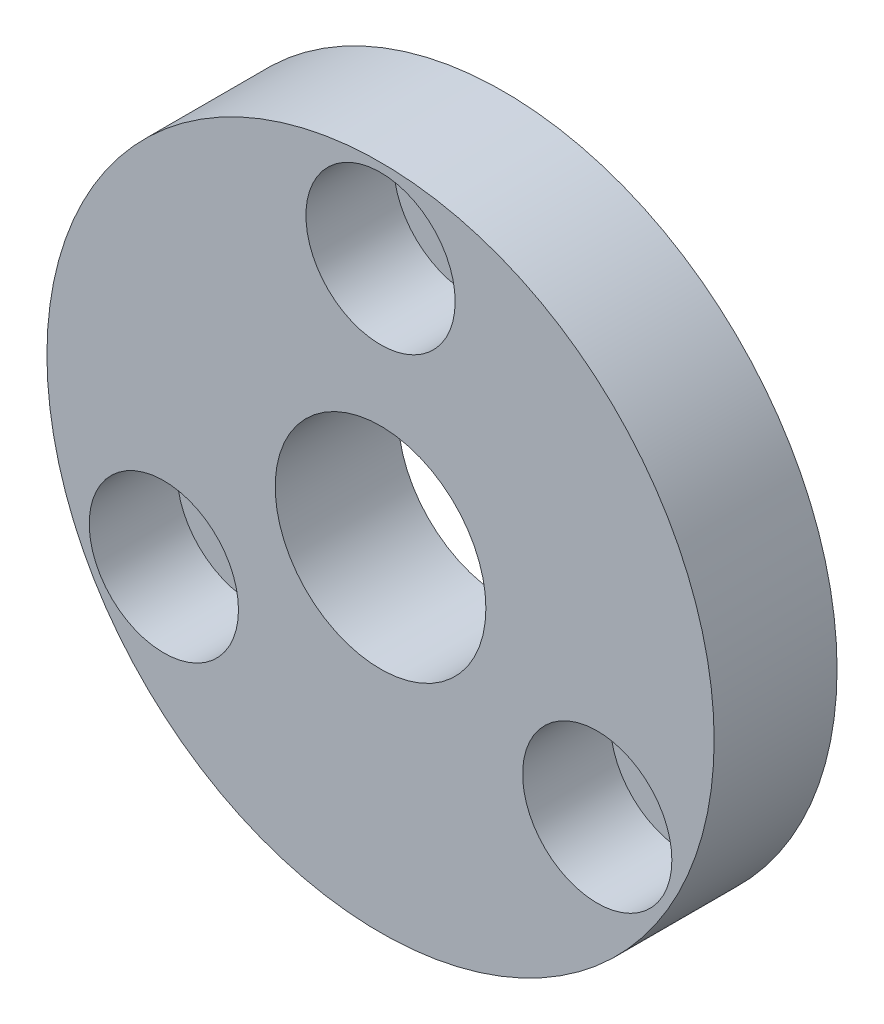
ISO-10303-21;
HEADER;
FILE_DESCRIPTION(('STEP AP214'),'2;1');
FILE_NAME('part.step','',(''),(''),'','','');
FILE_SCHEMA(('AUTOMOTIVE_DESIGN { 1 0 10303 214 1 1 1 1 }'));
ENDSEC;
DATA;
#1=APPLICATION_CONTEXT('core data for automotive mechanical design processes');
#2=APPLICATION_PROTOCOL_DEFINITION('international standard','automotive_design',2000,#1);
#3=PRODUCT_CONTEXT('',#1,'mechanical');
#4=PRODUCT('Part','Part','',(#3));
#5=PRODUCT_RELATED_PRODUCT_CATEGORY('part','',(#4));
#6=PRODUCT_DEFINITION_FORMATION('','',#4);
#7=PRODUCT_DEFINITION_CONTEXT('part definition',#1,'design');
#8=PRODUCT_DEFINITION('design','',#6,#7);
#9=PRODUCT_DEFINITION_SHAPE('','',#8);
#10=(LENGTH_UNIT() NAMED_UNIT(*) SI_UNIT(.MILLI.,.METRE.));
#11=(NAMED_UNIT(*) PLANE_ANGLE_UNIT() SI_UNIT($,.RADIAN.));
#12=(NAMED_UNIT(*) SI_UNIT($,.STERADIAN.) SOLID_ANGLE_UNIT());
#13=UNCERTAINTY_MEASURE_WITH_UNIT(LENGTH_MEASURE(1.E-05),#10,'distance_accuracy_value','');
#14=(GEOMETRIC_REPRESENTATION_CONTEXT(3) GLOBAL_UNCERTAINTY_ASSIGNED_CONTEXT((#13)) GLOBAL_UNIT_ASSIGNED_CONTEXT((#10,
#11,#12)) REPRESENTATION_CONTEXT('',''));
#15=CARTESIAN_POINT('',(0.,0.,0.));
#16=DIRECTION('',(0.,0.,1.));
#17=DIRECTION('',(1.,0.,0.));
#18=AXIS2_PLACEMENT_3D('',#15,#16,#17);
#19=CARTESIAN_POINT('',(12.3408620039285,-7.12499999999986,7.));
#20=DIRECTION('',(0.,0.,-1.));
#21=DIRECTION('',(-1.,0.,0.));
#22=AXIS2_PLACEMENT_3D('',#19,#20,#21);
#23=CYLINDRICAL_SURFACE('',#22,2.5);
#24=CARTESIAN_POINT('',(12.3408620039285,-7.12499999999986,0.));
#25=DIRECTION('',(0.,0.,1.));
#26=DIRECTION('',(1.,0.,0.));
#27=AXIS2_PLACEMENT_3D('',#24,#25,#26);
#28=CIRCLE('',#27,2.5);
#29=CARTESIAN_POINT('',(14.8408620039285,-7.12499999999986,0.));
#30=VERTEX_POINT('',#29);
#31=EDGE_CURVE('E75',#30,#30,#28,.T.);
#32=ORIENTED_EDGE('',*,*,#31,.F.);
#33=EDGE_LOOP('',(#32));
#34=FACE_BOUND('',#33,.T.);
#35=CARTESIAN_POINT('',(12.3408620039285,-7.12499999999986,2.));
#36=DIRECTION('',(0.,0.,1.));
#37=DIRECTION('',(1.,0.,0.));
#38=AXIS2_PLACEMENT_3D('',#35,#36,#37);
#39=CIRCLE('',#38,2.5);
#40=CARTESIAN_POINT('',(14.8408620039285,-7.12499999999986,2.));
#41=VERTEX_POINT('',#40);
#42=EDGE_CURVE('E33',#41,#41,#39,.T.);
#43=ORIENTED_EDGE('',*,*,#42,.T.);
#44=EDGE_LOOP('',(#43));
#45=FACE_BOUND('',#44,.T.);
#46=ADVANCED_FACE('F29',(#34,#45),#23,.F.);
#47=CARTESIAN_POINT('',(-12.340862003928,-7.12500000000014,7.));
#48=DIRECTION('',(0.,0.,-1.));
#49=DIRECTION('',(-1.,0.,0.));
#50=AXIS2_PLACEMENT_3D('',#47,#48,#49);
#51=CYLINDRICAL_SURFACE('',#50,2.5);
#52=CARTESIAN_POINT('',(-12.340862003928,-7.12500000000014,0.));
#53=DIRECTION('',(0.,0.,1.));
#54=DIRECTION('',(1.,0.,0.));
#55=AXIS2_PLACEMENT_3D('',#52,#53,#54);
#56=CIRCLE('',#55,2.5);
#57=CARTESIAN_POINT('',(-9.84086200392801,-7.12500000000014,0.));
#58=VERTEX_POINT('',#57);
#59=EDGE_CURVE('E50',#58,#58,#56,.T.);
#60=ORIENTED_EDGE('',*,*,#59,.F.);
#61=EDGE_LOOP('',(#60));
#62=FACE_BOUND('',#61,.T.);
#63=CARTESIAN_POINT('',(-12.340862003928,-7.12500000000014,2.));
#64=DIRECTION('',(0.,0.,1.));
#65=DIRECTION('',(1.,0.,0.));
#66=AXIS2_PLACEMENT_3D('',#63,#64,#65);
#67=CIRCLE('',#66,2.5);
#68=CARTESIAN_POINT('',(-9.84086200392801,-7.12500000000014,2.));
#69=VERTEX_POINT('',#68);
#70=EDGE_CURVE('E52',#69,#69,#67,.T.);
#71=ORIENTED_EDGE('',*,*,#70,.T.);
#72=EDGE_LOOP('',(#71));
#73=FACE_BOUND('',#72,.T.);
#74=ADVANCED_FACE('F104',(#62,#73),#51,.F.);
#75=CARTESIAN_POINT('',(0.,14.25,7.));
#76=DIRECTION('',(0.,0.,-1.));
#77=DIRECTION('',(-1.,0.,0.));
#78=AXIS2_PLACEMENT_3D('',#75,#76,#77);
#79=CYLINDRICAL_SURFACE('',#78,2.5);
#80=CARTESIAN_POINT('',(0.,14.25,0.));
#81=DIRECTION('',(0.,0.,1.));
#82=DIRECTION('',(1.,0.,0.));
#83=AXIS2_PLACEMENT_3D('',#80,#81,#82);
#84=CIRCLE('',#83,2.5);
#85=CARTESIAN_POINT('',(2.5,14.25,0.));
#86=VERTEX_POINT('',#85);
#87=EDGE_CURVE('E78',#86,#86,#84,.T.);
#88=ORIENTED_EDGE('',*,*,#87,.F.);
#89=EDGE_LOOP('',(#88));
#90=FACE_BOUND('',#89,.T.);
#91=CARTESIAN_POINT('',(0.,14.25,2.));
#92=DIRECTION('',(0.,0.,1.));
#93=DIRECTION('',(1.,0.,0.));
#94=AXIS2_PLACEMENT_3D('',#91,#92,#93);
#95=CIRCLE('',#94,2.5);
#96=CARTESIAN_POINT('',(2.5,14.25,2.));
#97=VERTEX_POINT('',#96);
#98=EDGE_CURVE('E48',#97,#97,#95,.T.);
#99=ORIENTED_EDGE('',*,*,#98,.T.);
#100=EDGE_LOOP('',(#99));
#101=FACE_BOUND('',#100,.T.);
#102=ADVANCED_FACE('F110',(#90,#101),#79,.F.);
#103=CARTESIAN_POINT('',(0.,0.,7.));
#104=DIRECTION('',(0.,0.,1.));
#105=DIRECTION('',(1.,0.,0.));
#106=AXIS2_PLACEMENT_3D('',#103,#104,#105);
#107=PLANE('',#106);
#108=CARTESIAN_POINT('',(12.3408620039285,-7.12499999999986,7.));
#109=DIRECTION('',(0.,0.,1.));
#110=DIRECTION('',(1.,0.,0.));
#111=AXIS2_PLACEMENT_3D('',#108,#109,#110);
#112=CIRCLE('',#111,4.25);
#113=CARTESIAN_POINT('',(16.5908620039285,-7.12499999999986,7.));
#114=VERTEX_POINT('',#113);
#115=EDGE_CURVE('E68',#114,#114,#112,.T.);
#116=ORIENTED_EDGE('',*,*,#115,.F.);
#117=EDGE_LOOP('',(#116));
#118=FACE_BOUND('',#117,.T.);
#119=CARTESIAN_POINT('',(-12.340862003928,-7.12500000000014,7.));
#120=DIRECTION('',(0.,0.,1.));
#121=DIRECTION('',(1.,0.,0.));
#122=AXIS2_PLACEMENT_3D('',#119,#120,#121);
#123=CIRCLE('',#122,4.25);
#124=CARTESIAN_POINT('',(-8.09086200392801,-7.12500000000014,7.));
#125=VERTEX_POINT('',#124);
#126=EDGE_CURVE('E61',#125,#125,#123,.T.);
#127=ORIENTED_EDGE('',*,*,#126,.F.);
#128=EDGE_LOOP('',(#127));
#129=FACE_BOUND('',#128,.T.);
#130=CARTESIAN_POINT('',(0.,14.25,7.));
#131=DIRECTION('',(0.,0.,1.));
#132=DIRECTION('',(1.,0.,0.));
#133=AXIS2_PLACEMENT_3D('',#130,#131,#132);
#134=CIRCLE('',#133,4.25);
#135=CARTESIAN_POINT('',(4.25,14.25,7.));
#136=VERTEX_POINT('',#135);
#137=EDGE_CURVE('E54',#136,#136,#134,.T.);
#138=ORIENTED_EDGE('',*,*,#137,.F.);
#139=EDGE_LOOP('',(#138));
#140=FACE_BOUND('',#139,.T.);
#141=CARTESIAN_POINT('',(0.,0.,7.));
#142=DIRECTION('',(0.,0.,1.));
#143=DIRECTION('',(1.,0.,0.));
#144=AXIS2_PLACEMENT_3D('',#141,#142,#143);
#145=CIRCLE('',#144,6.);
#146=CARTESIAN_POINT('',(6.,0.,7.));
#147=VERTEX_POINT('',#146);
#148=EDGE_CURVE('E42',#147,#147,#145,.T.);
#149=ORIENTED_EDGE('',*,*,#148,.F.);
#150=EDGE_LOOP('',(#149));
#151=FACE_BOUND('',#150,.T.);
#152=CARTESIAN_POINT('',(0.,0.,7.));
#153=DIRECTION('',(0.,0.,1.));
#154=DIRECTION('',(1.,0.,0.));
#155=AXIS2_PLACEMENT_3D('',#152,#153,#154);
#156=CIRCLE('',#155,19.);
#157=CARTESIAN_POINT('',(19.,0.,7.));
#158=VERTEX_POINT('',#157);
#159=EDGE_CURVE('E10',#158,#158,#156,.T.);
#160=ORIENTED_EDGE('',*,*,#159,.T.);
#161=EDGE_LOOP('',(#160));
#162=FACE_BOUND('',#161,.T.);
#163=ADVANCED_FACE('F116',(#118,#129,#140,#151,#162),#107,.T.);
#164=CARTESIAN_POINT('',(0.,0.,0.));
#165=DIRECTION('',(0.,0.,1.));
#166=DIRECTION('',(1.,0.,0.));
#167=AXIS2_PLACEMENT_3D('',#164,#165,#166);
#168=PLANE('',#167);
#169=ORIENTED_EDGE('',*,*,#31,.T.);
#170=EDGE_LOOP('',(#169));
#171=FACE_BOUND('',#170,.T.);
#172=CARTESIAN_POINT('',(0.,0.,0.));
#173=DIRECTION('',(0.,0.,1.));
#174=DIRECTION('',(1.,0.,0.));
#175=AXIS2_PLACEMENT_3D('',#172,#173,#174);
#176=CIRCLE('',#175,6.);
#177=CARTESIAN_POINT('',(6.,0.,0.));
#178=VERTEX_POINT('',#177);
#179=EDGE_CURVE('E45',#178,#178,#176,.T.);
#180=ORIENTED_EDGE('',*,*,#179,.T.);
#181=EDGE_LOOP('',(#180));
#182=FACE_BOUND('',#181,.T.);
#183=CARTESIAN_POINT('',(0.,0.,0.));
#184=DIRECTION('',(0.,0.,1.));
#185=DIRECTION('',(1.,0.,0.));
#186=AXIS2_PLACEMENT_3D('',#183,#184,#185);
#187=CIRCLE('',#186,19.);
#188=CARTESIAN_POINT('',(19.,0.,0.));
#189=VERTEX_POINT('',#188);
#190=EDGE_CURVE('E37',#189,#189,#187,.T.);
#191=ORIENTED_EDGE('',*,*,#190,.F.);
#192=EDGE_LOOP('',(#191));
#193=FACE_BOUND('',#192,.T.);
#194=ORIENTED_EDGE('',*,*,#87,.T.);
#195=EDGE_LOOP('',(#194));
#196=FACE_BOUND('',#195,.T.);
#197=ORIENTED_EDGE('',*,*,#59,.T.);
#198=EDGE_LOOP('',(#197));
#199=FACE_BOUND('',#198,.T.);
#200=ADVANCED_FACE('F86',(#171,#182,#193,#196,#199),#168,.F.);
#201=CARTESIAN_POINT('',(0.,0.,7.));
#202=DIRECTION('',(0.,0.,-1.));
#203=DIRECTION('',(-1.,0.,0.));
#204=AXIS2_PLACEMENT_3D('',#201,#202,#203);
#205=CYLINDRICAL_SURFACE('',#204,19.);
#206=ORIENTED_EDGE('',*,*,#159,.F.);
#207=EDGE_LOOP('',(#206));
#208=FACE_BOUND('',#207,.T.);
#209=ORIENTED_EDGE('',*,*,#190,.T.);
#210=EDGE_LOOP('',(#209));
#211=FACE_BOUND('',#210,.T.);
#212=ADVANCED_FACE('F31',(#208,#211),#205,.T.);
#213=CARTESIAN_POINT('',(0.,0.,7.));
#214=DIRECTION('',(0.,0.,-1.));
#215=DIRECTION('',(-1.,0.,0.));
#216=AXIS2_PLACEMENT_3D('',#213,#214,#215);
#217=CYLINDRICAL_SURFACE('',#216,6.);
#218=ORIENTED_EDGE('',*,*,#148,.T.);
#219=EDGE_LOOP('',(#218));
#220=FACE_BOUND('',#219,.T.);
#221=ORIENTED_EDGE('',*,*,#179,.F.);
#222=EDGE_LOOP('',(#221));
#223=FACE_BOUND('',#222,.T.);
#224=ADVANCED_FACE('F89',(#220,#223),#217,.F.);
#225=CARTESIAN_POINT('',(0.,14.25,2.));
#226=DIRECTION('',(0.,0.,1.));
#227=DIRECTION('',(1.,0.,0.));
#228=AXIS2_PLACEMENT_3D('',#225,#226,#227);
#229=CYLINDRICAL_SURFACE('',#228,4.25);
#230=CARTESIAN_POINT('',(0.,14.25,2.));
#231=DIRECTION('',(0.,0.,1.));
#232=DIRECTION('',(1.,0.,0.));
#233=AXIS2_PLACEMENT_3D('',#230,#231,#232);
#234=CIRCLE('',#233,4.25);
#235=CARTESIAN_POINT('',(4.25,14.25,2.));
#236=VERTEX_POINT('',#235);
#237=EDGE_CURVE('E51',#236,#236,#234,.T.);
#238=ORIENTED_EDGE('',*,*,#237,.F.);
#239=EDGE_LOOP('',(#238));
#240=FACE_BOUND('',#239,.T.);
#241=ORIENTED_EDGE('',*,*,#137,.T.);
#242=EDGE_LOOP('',(#241));
#243=FACE_BOUND('',#242,.T.);
#244=ADVANCED_FACE('F91',(#240,#243),#229,.F.);
#245=CARTESIAN_POINT('',(0.,14.25,2.));
#246=DIRECTION('',(0.,0.,1.));
#247=DIRECTION('',(1.,0.,0.));
#248=AXIS2_PLACEMENT_3D('',#245,#246,#247);
#249=PLANE('',#248);
#250=ORIENTED_EDGE('',*,*,#98,.F.);
#251=EDGE_LOOP('',(#250));
#252=FACE_BOUND('',#251,.T.);
#253=ORIENTED_EDGE('',*,*,#237,.T.);
#254=EDGE_LOOP('',(#253));
#255=FACE_BOUND('',#254,.T.);
#256=ADVANCED_FACE('F97',(#252,#255),#249,.T.);
#257=CARTESIAN_POINT('',(-12.340862003928,-7.12500000000014,2.));
#258=DIRECTION('',(0.,0.,1.));
#259=DIRECTION('',(1.,0.,0.));
#260=AXIS2_PLACEMENT_3D('',#257,#258,#259);
#261=CYLINDRICAL_SURFACE('',#260,4.25);
#262=CARTESIAN_POINT('',(-12.340862003928,-7.12500000000014,2.));
#263=DIRECTION('',(0.,0.,1.));
#264=DIRECTION('',(1.,0.,0.));
#265=AXIS2_PLACEMENT_3D('',#262,#263,#264);
#266=CIRCLE('',#265,4.25);
#267=CARTESIAN_POINT('',(-8.09086200392801,-7.12500000000014,2.));
#268=VERTEX_POINT('',#267);
#269=EDGE_CURVE('E55',#268,#268,#266,.T.);
#270=ORIENTED_EDGE('',*,*,#269,.F.);
#271=EDGE_LOOP('',(#270));
#272=FACE_BOUND('',#271,.T.);
#273=ORIENTED_EDGE('',*,*,#126,.T.);
#274=EDGE_LOOP('',(#273));
#275=FACE_BOUND('',#274,.T.);
#276=ADVANCED_FACE('F128',(#272,#275),#261,.F.);
#277=CARTESIAN_POINT('',(-12.340862003928,-7.12500000000014,2.));
#278=DIRECTION('',(0.,0.,1.));
#279=DIRECTION('',(1.,0.,0.));
#280=AXIS2_PLACEMENT_3D('',#277,#278,#279);
#281=PLANE('',#280);
#282=ORIENTED_EDGE('',*,*,#70,.F.);
#283=EDGE_LOOP('',(#282));
#284=FACE_BOUND('',#283,.T.);
#285=ORIENTED_EDGE('',*,*,#269,.T.);
#286=EDGE_LOOP('',(#285));
#287=FACE_BOUND('',#286,.T.);
#288=ADVANCED_FACE('F138',(#284,#287),#281,.T.);
#289=CARTESIAN_POINT('',(12.3408620039285,-7.12499999999986,2.));
#290=DIRECTION('',(0.,0.,1.));
#291=DIRECTION('',(1.,0.,0.));
#292=AXIS2_PLACEMENT_3D('',#289,#290,#291);
#293=CYLINDRICAL_SURFACE('',#292,4.25);
#294=CARTESIAN_POINT('',(12.3408620039285,-7.12499999999986,2.));
#295=DIRECTION('',(0.,0.,1.));
#296=DIRECTION('',(1.,0.,0.));
#297=AXIS2_PLACEMENT_3D('',#294,#295,#296);
#298=CIRCLE('',#297,4.25);
#299=CARTESIAN_POINT('',(16.5908620039285,-7.12499999999986,2.));
#300=VERTEX_POINT('',#299);
#301=EDGE_CURVE('E159',#300,#300,#298,.T.);
#302=ORIENTED_EDGE('',*,*,#301,.F.);
#303=EDGE_LOOP('',(#302));
#304=FACE_BOUND('',#303,.T.);
#305=ORIENTED_EDGE('',*,*,#115,.T.);
#306=EDGE_LOOP('',(#305));
#307=FACE_BOUND('',#306,.T.);
#308=ADVANCED_FACE('F144',(#304,#307),#293,.F.);
#309=CARTESIAN_POINT('',(12.3408620039285,-7.12499999999986,2.));
#310=DIRECTION('',(0.,0.,1.));
#311=DIRECTION('',(1.,0.,0.));
#312=AXIS2_PLACEMENT_3D('',#309,#310,#311);
#313=PLANE('',#312);
#314=ORIENTED_EDGE('',*,*,#42,.F.);
#315=EDGE_LOOP('',(#314));
#316=FACE_BOUND('',#315,.T.);
#317=ORIENTED_EDGE('',*,*,#301,.T.);
#318=EDGE_LOOP('',(#317));
#319=FACE_BOUND('',#318,.T.);
#320=ADVANCED_FACE('F148',(#316,#319),#313,.T.);
#321=CLOSED_SHELL('',(#46,#74,#102,#163,#200,#212,#224,#244,#256,#276,#288,#308,#320));
#322=MANIFOLD_SOLID_BREP('B2',#321);
#323=ADVANCED_BREP_SHAPE_REPRESENTATION('',(#18,#322),#14);
#324=SHAPE_DEFINITION_REPRESENTATION(#9,#323);
ENDSEC;
END-ISO-10303-21;
